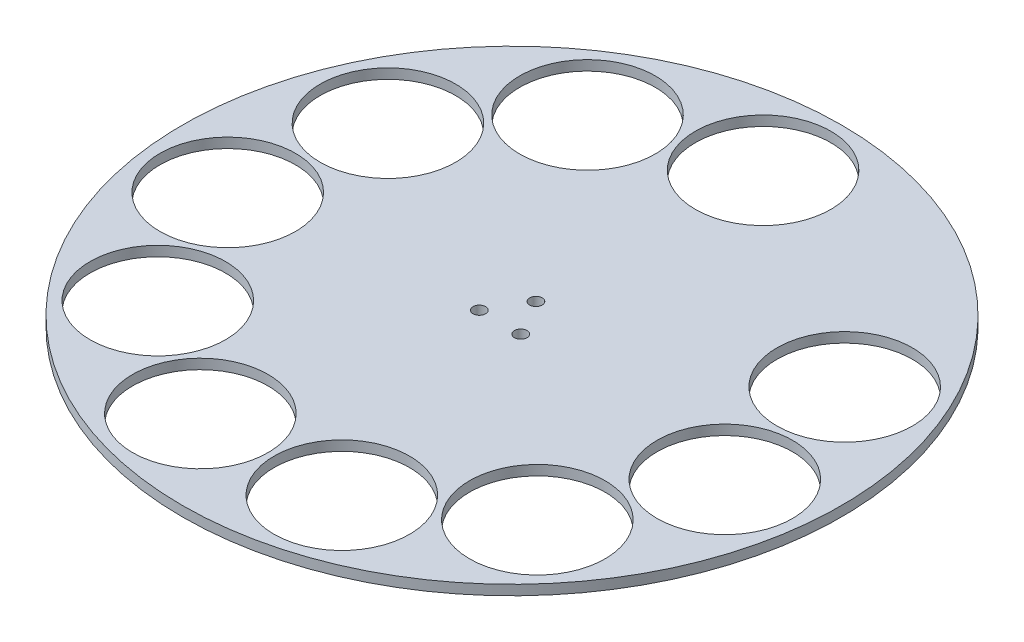
ISO-10303-21;
HEADER;
FILE_DESCRIPTION(('STEP AP214'),'2;1');
FILE_NAME('part.step','',(''),(''),'','','');
FILE_SCHEMA(('AUTOMOTIVE_DESIGN { 1 0 10303 214 1 1 1 1 }'));
ENDSEC;
DATA;
#1=APPLICATION_CONTEXT('core data for automotive mechanical design processes');
#2=APPLICATION_PROTOCOL_DEFINITION('international standard','automotive_design',2000,#1);
#3=PRODUCT_CONTEXT('',#1,'mechanical');
#4=PRODUCT('Part','Part','',(#3));
#5=PRODUCT_RELATED_PRODUCT_CATEGORY('part','',(#4));
#6=PRODUCT_DEFINITION_FORMATION('','',#4);
#7=PRODUCT_DEFINITION_CONTEXT('part definition',#1,'design');
#8=PRODUCT_DEFINITION('design','',#6,#7);
#9=PRODUCT_DEFINITION_SHAPE('','',#8);
#10=(LENGTH_UNIT() NAMED_UNIT(*) SI_UNIT(.MILLI.,.METRE.));
#11=(NAMED_UNIT(*) PLANE_ANGLE_UNIT() SI_UNIT($,.RADIAN.));
#12=(NAMED_UNIT(*) SI_UNIT($,.STERADIAN.) SOLID_ANGLE_UNIT());
#13=UNCERTAINTY_MEASURE_WITH_UNIT(LENGTH_MEASURE(1.E-05),#10,'distance_accuracy_value','');
#14=(GEOMETRIC_REPRESENTATION_CONTEXT(3) GLOBAL_UNCERTAINTY_ASSIGNED_CONTEXT((#13)) GLOBAL_UNIT_ASSIGNED_CONTEXT((#10,
#11,#12)) REPRESENTATION_CONTEXT('',''));
#15=CARTESIAN_POINT('',(0.,0.,0.));
#16=DIRECTION('',(0.,0.,1.));
#17=DIRECTION('',(1.,0.,0.));
#18=AXIS2_PLACEMENT_3D('',#15,#16,#17);
#19=CARTESIAN_POINT('',(0.,3.175,0.));
#20=DIRECTION('',(0.,1.,0.));
#21=DIRECTION('',(0.,0.,1.));
#22=AXIS2_PLACEMENT_3D('',#19,#20,#21);
#23=PLANE('',#22);
#24=CARTESIAN_POINT('',(6.59911357683764,3.175,3.80999999999988));
#25=DIRECTION('',(0.,1.,0.));
#26=DIRECTION('',(0.,0.,1.));
#27=AXIS2_PLACEMENT_3D('',#24,#25,#26);
#28=CIRCLE('',#27,2.);
#29=CARTESIAN_POINT('',(6.59911357683764,3.175,5.80999999999988));
#30=VERTEX_POINT('',#29);
#31=EDGE_CURVE('E107',#30,#30,#28,.T.);
#32=ORIENTED_EDGE('',*,*,#31,.F.);
#33=EDGE_LOOP('',(#32));
#34=FACE_BOUND('',#33,.T.);
#35=CARTESIAN_POINT('',(-72.7705596283575,3.175,-33.2332010401447));
#36=DIRECTION('',(0.,1.,0.));
#37=DIRECTION('',(0.,0.,1.));
#38=AXIS2_PLACEMENT_3D('',#35,#36,#37);
#39=CIRCLE('',#38,21.59);
#40=CARTESIAN_POINT('',(-72.7705596283575,3.175,-11.6432010401447));
#41=VERTEX_POINT('',#40);
#42=EDGE_CURVE('E95',#41,#41,#39,.T.);
#43=ORIENTED_EDGE('',*,*,#42,.F.);
#44=EDGE_LOOP('',(#43));
#45=FACE_BOUND('',#44,.T.);
#46=CARTESIAN_POINT('',(-60.4599659483295,3.175,52.3888587156279));
#47=DIRECTION('',(0.,1.,0.));
#48=DIRECTION('',(0.,0.,1.));
#49=AXIS2_PLACEMENT_3D('',#46,#47,#48);
#50=CIRCLE('',#49,21.59);
#51=CARTESIAN_POINT('',(-60.4599659483295,3.175,73.9788587156279));
#52=VERTEX_POINT('',#51);
#53=EDGE_CURVE('E83',#52,#52,#50,.T.);
#54=ORIENTED_EDGE('',*,*,#53,.F.);
#55=EDGE_LOOP('',(#54));
#56=FACE_BOUND('',#55,.T.);
#57=CARTESIAN_POINT('',(22.5386045473276,3.175,76.7594378891579));
#58=DIRECTION('',(0.,1.,0.));
#59=DIRECTION('',(0.,0.,1.));
#60=AXIS2_PLACEMENT_3D('',#57,#58,#59);
#61=CIRCLE('',#60,21.59);
#62=CARTESIAN_POINT('',(22.5386045473276,3.175,98.3494378891579));
#63=VERTEX_POINT('',#62);
#64=EDGE_CURVE('E71',#63,#63,#61,.T.);
#65=ORIENTED_EDGE('',*,*,#64,.F.);
#66=EDGE_LOOP('',(#65));
#67=FACE_BOUND('',#66,.T.);
#68=CARTESIAN_POINT('',(79.1857153504824,3.175,11.3851870618561));
#69=DIRECTION('',(0.,1.,0.));
#70=DIRECTION('',(0.,0.,1.));
#71=AXIS2_PLACEMENT_3D('',#68,#69,#70);
#72=CIRCLE('',#71,21.59);
#73=CARTESIAN_POINT('',(79.1857153504824,3.175,32.9751870618561));
#74=VERTEX_POINT('',#73);
#75=EDGE_CURVE('E59',#74,#74,#72,.T.);
#76=ORIENTED_EDGE('',*,*,#75,.F.);
#77=EDGE_LOOP('',(#76));
#78=FACE_BOUND('',#77,.T.);
#79=CARTESIAN_POINT('',(0.,3.175,-7.62));
#80=DIRECTION('',(0.,1.,0.));
#81=DIRECTION('',(0.,0.,1.));
#82=AXIS2_PLACEMENT_3D('',#79,#80,#81);
#83=CIRCLE('',#82,2.);
#84=CARTESIAN_POINT('',(0.,3.175,-5.62));
#85=VERTEX_POINT('',#84);
#86=EDGE_CURVE('E47',#85,#85,#83,.T.);
#87=ORIENTED_EDGE('',*,*,#86,.F.);
#88=EDGE_LOOP('',(#87));
#89=FACE_BOUND('',#88,.T.);
#90=CARTESIAN_POINT('',(0.,3.175,0.));
#91=DIRECTION('',(0.,1.,0.));
#92=DIRECTION('',(0.,0.,1.));
#93=AXIS2_PLACEMENT_3D('',#90,#91,#92);
#94=CIRCLE('',#93,105.);
#95=CARTESIAN_POINT('',(0.,3.175,105.));
#96=VERTEX_POINT('',#95);
#97=EDGE_CURVE('E10',#96,#96,#94,.T.);
#98=ORIENTED_EDGE('',*,*,#97,.T.);
#99=EDGE_LOOP('',(#98));
#100=FACE_BOUND('',#99,.T.);
#101=CARTESIAN_POINT('',(0.,3.175,-80.));
#102=DIRECTION('',(0.,1.,0.));
#103=DIRECTION('',(0.,0.,1.));
#104=AXIS2_PLACEMENT_3D('',#101,#102,#103);
#105=CIRCLE('',#104,21.59);
#106=CARTESIAN_POINT('',(0.,3.175,-58.41));
#107=VERTEX_POINT('',#106);
#108=EDGE_CURVE('E42',#107,#107,#105,.T.);
#109=ORIENTED_EDGE('',*,*,#108,.F.);
#110=EDGE_LOOP('',(#109));
#111=FACE_BOUND('',#110,.T.);
#112=CARTESIAN_POINT('',(72.7705596283654,3.175,-33.2332010401571));
#113=DIRECTION('',(0.,1.,0.));
#114=DIRECTION('',(0.,0.,1.));
#115=AXIS2_PLACEMENT_3D('',#112,#113,#114);
#116=CIRCLE('',#115,21.59);
#117=CARTESIAN_POINT('',(72.7705596283654,3.175,-11.6432010401571));
#118=VERTEX_POINT('',#117);
#119=EDGE_CURVE('E53',#118,#118,#116,.T.);
#120=ORIENTED_EDGE('',*,*,#119,.F.);
#121=EDGE_LOOP('',(#120));
#122=FACE_BOUND('',#121,.T.);
#123=CARTESIAN_POINT('',(60.4599659483519,3.175,52.3888587156177));
#124=DIRECTION('',(0.,1.,0.));
#125=DIRECTION('',(0.,0.,1.));
#126=AXIS2_PLACEMENT_3D('',#123,#124,#125);
#127=CIRCLE('',#126,21.59);
#128=CARTESIAN_POINT('',(60.4599659483519,3.175,73.9788587156177));
#129=VERTEX_POINT('',#128);
#130=EDGE_CURVE('E65',#129,#129,#127,.T.);
#131=ORIENTED_EDGE('',*,*,#130,.F.);
#132=EDGE_LOOP('',(#131));
#133=FACE_BOUND('',#132,.T.);
#134=CARTESIAN_POINT('',(-22.5386045473011,3.175,76.7594378891617));
#135=DIRECTION('',(0.,1.,0.));
#136=DIRECTION('',(0.,0.,1.));
#137=AXIS2_PLACEMENT_3D('',#134,#135,#136);
#138=CIRCLE('',#137,21.59);
#139=CARTESIAN_POINT('',(-22.5386045473011,3.175,98.3494378891617));
#140=VERTEX_POINT('',#139);
#141=EDGE_CURVE('E77',#140,#140,#138,.T.);
#142=ORIENTED_EDGE('',*,*,#141,.F.);
#143=EDGE_LOOP('',(#142));
#144=FACE_BOUND('',#143,.T.);
#145=CARTESIAN_POINT('',(-79.1857153504669,3.175,11.3851870618695));
#146=DIRECTION('',(0.,1.,0.));
#147=DIRECTION('',(0.,0.,1.));
#148=AXIS2_PLACEMENT_3D('',#145,#146,#147);
#149=CIRCLE('',#148,21.59);
#150=CARTESIAN_POINT('',(-79.1857153504669,3.175,32.9751870618695));
#151=VERTEX_POINT('',#150);
#152=EDGE_CURVE('E89',#151,#151,#149,.T.);
#153=ORIENTED_EDGE('',*,*,#152,.F.);
#154=EDGE_LOOP('',(#153));
#155=FACE_BOUND('',#154,.T.);
#156=CARTESIAN_POINT('',(-43.2512653964467,3.175,-67.3002826264909));
#157=DIRECTION('',(0.,1.,0.));
#158=DIRECTION('',(0.,0.,1.));
#159=AXIS2_PLACEMENT_3D('',#156,#157,#158);
#160=CIRCLE('',#159,21.59);
#161=CARTESIAN_POINT('',(-43.2512653964467,3.175,-45.7102826264908));
#162=VERTEX_POINT('',#161);
#163=EDGE_CURVE('E101',#162,#162,#160,.T.);
#164=ORIENTED_EDGE('',*,*,#163,.F.);
#165=EDGE_LOOP('',(#164));
#166=FACE_BOUND('',#165,.T.);
#167=CARTESIAN_POINT('',(-6.59911357683721,3.175,3.81000000000012));
#168=DIRECTION('',(0.,1.,0.));
#169=DIRECTION('',(0.,0.,1.));
#170=AXIS2_PLACEMENT_3D('',#167,#168,#169);
#171=CIRCLE('',#170,2.);
#172=CARTESIAN_POINT('',(-6.59911357683721,3.175,5.81000000000013));
#173=VERTEX_POINT('',#172);
#174=EDGE_CURVE('E113',#173,#173,#171,.T.);
#175=ORIENTED_EDGE('',*,*,#174,.F.);
#176=EDGE_LOOP('',(#175));
#177=FACE_BOUND('',#176,.T.);
#178=ADVANCED_FACE('F31',(#34,#45,#56,#67,#78,#89,#100,#111,#122,#133,#144,#155,#166,#177),#23,.T.);
#179=CARTESIAN_POINT('',(0.,0.,0.));
#180=DIRECTION('',(0.,1.,0.));
#181=DIRECTION('',(0.,0.,1.));
#182=AXIS2_PLACEMENT_3D('',#179,#180,#181);
#183=PLANE('',#182);
#184=CARTESIAN_POINT('',(0.,0.,0.));
#185=DIRECTION('',(0.,1.,0.));
#186=DIRECTION('',(0.,0.,1.));
#187=AXIS2_PLACEMENT_3D('',#184,#185,#186);
#188=CIRCLE('',#187,105.);
#189=CARTESIAN_POINT('',(0.,0.,105.));
#190=VERTEX_POINT('',#189);
#191=EDGE_CURVE('E35',#190,#190,#188,.T.);
#192=ORIENTED_EDGE('',*,*,#191,.F.);
#193=EDGE_LOOP('',(#192));
#194=FACE_BOUND('',#193,.T.);
#195=CARTESIAN_POINT('',(0.,0.,-80.));
#196=DIRECTION('',(0.,1.,0.));
#197=DIRECTION('',(0.,0.,1.));
#198=AXIS2_PLACEMENT_3D('',#195,#196,#197);
#199=CIRCLE('',#198,21.59);
#200=CARTESIAN_POINT('',(0.,0.,-58.41));
#201=VERTEX_POINT('',#200);
#202=EDGE_CURVE('E44',#201,#201,#199,.T.);
#203=ORIENTED_EDGE('',*,*,#202,.T.);
#204=EDGE_LOOP('',(#203));
#205=FACE_BOUND('',#204,.T.);
#206=CARTESIAN_POINT('',(0.,0.,-7.62));
#207=DIRECTION('',(0.,1.,0.));
#208=DIRECTION('',(0.,0.,1.));
#209=AXIS2_PLACEMENT_3D('',#206,#207,#208);
#210=CIRCLE('',#209,2.);
#211=CARTESIAN_POINT('',(0.,0.,-5.62));
#212=VERTEX_POINT('',#211);
#213=EDGE_CURVE('E50',#212,#212,#210,.T.);
#214=ORIENTED_EDGE('',*,*,#213,.T.);
#215=EDGE_LOOP('',(#214));
#216=FACE_BOUND('',#215,.T.);
#217=CARTESIAN_POINT('',(72.7705596283654,0.,-33.2332010401571));
#218=DIRECTION('',(0.,1.,0.));
#219=DIRECTION('',(0.,0.,1.));
#220=AXIS2_PLACEMENT_3D('',#217,#218,#219);
#221=CIRCLE('',#220,21.59);
#222=CARTESIAN_POINT('',(72.7705596283654,0.,-11.6432010401571));
#223=VERTEX_POINT('',#222);
#224=EDGE_CURVE('E56',#223,#223,#221,.T.);
#225=ORIENTED_EDGE('',*,*,#224,.T.);
#226=EDGE_LOOP('',(#225));
#227=FACE_BOUND('',#226,.T.);
#228=CARTESIAN_POINT('',(79.1857153504824,0.,11.3851870618561));
#229=DIRECTION('',(0.,1.,0.));
#230=DIRECTION('',(0.,0.,1.));
#231=AXIS2_PLACEMENT_3D('',#228,#229,#230);
#232=CIRCLE('',#231,21.59);
#233=CARTESIAN_POINT('',(79.1857153504824,0.,32.9751870618561));
#234=VERTEX_POINT('',#233);
#235=EDGE_CURVE('E62',#234,#234,#232,.T.);
#236=ORIENTED_EDGE('',*,*,#235,.T.);
#237=EDGE_LOOP('',(#236));
#238=FACE_BOUND('',#237,.T.);
#239=CARTESIAN_POINT('',(60.4599659483519,0.,52.3888587156177));
#240=DIRECTION('',(0.,1.,0.));
#241=DIRECTION('',(0.,0.,1.));
#242=AXIS2_PLACEMENT_3D('',#239,#240,#241);
#243=CIRCLE('',#242,21.59);
#244=CARTESIAN_POINT('',(60.4599659483519,0.,73.9788587156177));
#245=VERTEX_POINT('',#244);
#246=EDGE_CURVE('E68',#245,#245,#243,.T.);
#247=ORIENTED_EDGE('',*,*,#246,.T.);
#248=EDGE_LOOP('',(#247));
#249=FACE_BOUND('',#248,.T.);
#250=CARTESIAN_POINT('',(22.5386045473276,0.,76.7594378891579));
#251=DIRECTION('',(0.,1.,0.));
#252=DIRECTION('',(0.,0.,1.));
#253=AXIS2_PLACEMENT_3D('',#250,#251,#252);
#254=CIRCLE('',#253,21.59);
#255=CARTESIAN_POINT('',(22.5386045473276,0.,98.3494378891579));
#256=VERTEX_POINT('',#255);
#257=EDGE_CURVE('E74',#256,#256,#254,.T.);
#258=ORIENTED_EDGE('',*,*,#257,.T.);
#259=EDGE_LOOP('',(#258));
#260=FACE_BOUND('',#259,.T.);
#261=CARTESIAN_POINT('',(-22.5386045473011,0.,76.7594378891617));
#262=DIRECTION('',(0.,1.,0.));
#263=DIRECTION('',(0.,0.,1.));
#264=AXIS2_PLACEMENT_3D('',#261,#262,#263);
#265=CIRCLE('',#264,21.59);
#266=CARTESIAN_POINT('',(-22.5386045473011,0.,98.3494378891617));
#267=VERTEX_POINT('',#266);
#268=EDGE_CURVE('E80',#267,#267,#265,.T.);
#269=ORIENTED_EDGE('',*,*,#268,.T.);
#270=EDGE_LOOP('',(#269));
#271=FACE_BOUND('',#270,.T.);
#272=CARTESIAN_POINT('',(-60.4599659483295,0.,52.3888587156279));
#273=DIRECTION('',(0.,1.,0.));
#274=DIRECTION('',(0.,0.,1.));
#275=AXIS2_PLACEMENT_3D('',#272,#273,#274);
#276=CIRCLE('',#275,21.59);
#277=CARTESIAN_POINT('',(-60.4599659483295,0.,73.9788587156279));
#278=VERTEX_POINT('',#277);
#279=EDGE_CURVE('E86',#278,#278,#276,.T.);
#280=ORIENTED_EDGE('',*,*,#279,.T.);
#281=EDGE_LOOP('',(#280));
#282=FACE_BOUND('',#281,.T.);
#283=CARTESIAN_POINT('',(-79.1857153504669,0.,11.3851870618695));
#284=DIRECTION('',(0.,1.,0.));
#285=DIRECTION('',(0.,0.,1.));
#286=AXIS2_PLACEMENT_3D('',#283,#284,#285);
#287=CIRCLE('',#286,21.59);
#288=CARTESIAN_POINT('',(-79.1857153504669,0.,32.9751870618695));
#289=VERTEX_POINT('',#288);
#290=EDGE_CURVE('E92',#289,#289,#287,.T.);
#291=ORIENTED_EDGE('',*,*,#290,.T.);
#292=EDGE_LOOP('',(#291));
#293=FACE_BOUND('',#292,.T.);
#294=CARTESIAN_POINT('',(-72.7705596283575,0.,-33.2332010401447));
#295=DIRECTION('',(0.,1.,0.));
#296=DIRECTION('',(0.,0.,1.));
#297=AXIS2_PLACEMENT_3D('',#294,#295,#296);
#298=CIRCLE('',#297,21.59);
#299=CARTESIAN_POINT('',(-72.7705596283575,0.,-11.6432010401447));
#300=VERTEX_POINT('',#299);
#301=EDGE_CURVE('E98',#300,#300,#298,.T.);
#302=ORIENTED_EDGE('',*,*,#301,.T.);
#303=EDGE_LOOP('',(#302));
#304=FACE_BOUND('',#303,.T.);
#305=CARTESIAN_POINT('',(-43.2512653964467,0.,-67.3002826264909));
#306=DIRECTION('',(0.,1.,0.));
#307=DIRECTION('',(0.,0.,1.));
#308=AXIS2_PLACEMENT_3D('',#305,#306,#307);
#309=CIRCLE('',#308,21.59);
#310=CARTESIAN_POINT('',(-43.2512653964467,0.,-45.7102826264908));
#311=VERTEX_POINT('',#310);
#312=EDGE_CURVE('E104',#311,#311,#309,.T.);
#313=ORIENTED_EDGE('',*,*,#312,.T.);
#314=EDGE_LOOP('',(#313));
#315=FACE_BOUND('',#314,.T.);
#316=CARTESIAN_POINT('',(6.59911357683764,0.,3.80999999999988));
#317=DIRECTION('',(0.,1.,0.));
#318=DIRECTION('',(0.,0.,1.));
#319=AXIS2_PLACEMENT_3D('',#316,#317,#318);
#320=CIRCLE('',#319,2.);
#321=CARTESIAN_POINT('',(6.59911357683764,0.,5.80999999999988));
#322=VERTEX_POINT('',#321);
#323=EDGE_CURVE('E110',#322,#322,#320,.T.);
#324=ORIENTED_EDGE('',*,*,#323,.T.);
#325=EDGE_LOOP('',(#324));
#326=FACE_BOUND('',#325,.T.);
#327=CARTESIAN_POINT('',(-6.59911357683721,0.,3.81000000000012));
#328=DIRECTION('',(0.,1.,0.));
#329=DIRECTION('',(0.,0.,1.));
#330=AXIS2_PLACEMENT_3D('',#327,#328,#329);
#331=CIRCLE('',#330,2.);
#332=CARTESIAN_POINT('',(-6.59911357683721,0.,5.81000000000013));
#333=VERTEX_POINT('',#332);
#334=EDGE_CURVE('E116',#333,#333,#331,.T.);
#335=ORIENTED_EDGE('',*,*,#334,.T.);
#336=EDGE_LOOP('',(#335));
#337=FACE_BOUND('',#336,.T.);
#338=ADVANCED_FACE('F126',(#194,#205,#216,#227,#238,#249,#260,#271,#282,#293,#304,#315,#326,
#337),#183,.F.);
#339=CARTESIAN_POINT('',(0.,3.175,0.));
#340=DIRECTION('',(0.,-1.,0.));
#341=DIRECTION('',(0.,0.,-1.));
#342=AXIS2_PLACEMENT_3D('',#339,#340,#341);
#343=CYLINDRICAL_SURFACE('',#342,105.);
#344=ORIENTED_EDGE('',*,*,#97,.F.);
#345=EDGE_LOOP('',(#344));
#346=FACE_BOUND('',#345,.T.);
#347=ORIENTED_EDGE('',*,*,#191,.T.);
#348=EDGE_LOOP('',(#347));
#349=FACE_BOUND('',#348,.T.);
#350=ADVANCED_FACE('F33',(#346,#349),#343,.T.);
#351=CARTESIAN_POINT('',(0.,3.175,-80.));
#352=DIRECTION('',(0.,-1.,0.));
#353=DIRECTION('',(0.,0.,-1.));
#354=AXIS2_PLACEMENT_3D('',#351,#352,#353);
#355=CYLINDRICAL_SURFACE('',#354,21.59);
#356=ORIENTED_EDGE('',*,*,#108,.T.);
#357=EDGE_LOOP('',(#356));
#358=FACE_BOUND('',#357,.T.);
#359=ORIENTED_EDGE('',*,*,#202,.F.);
#360=EDGE_LOOP('',(#359));
#361=FACE_BOUND('',#360,.T.);
#362=ADVANCED_FACE('F136',(#358,#361),#355,.F.);
#363=CARTESIAN_POINT('',(0.,3.175,-7.62));
#364=DIRECTION('',(0.,-1.,0.));
#365=DIRECTION('',(0.,0.,-1.));
#366=AXIS2_PLACEMENT_3D('',#363,#364,#365);
#367=CYLINDRICAL_SURFACE('',#366,2.);
#368=ORIENTED_EDGE('',*,*,#86,.T.);
#369=EDGE_LOOP('',(#368));
#370=FACE_BOUND('',#369,.T.);
#371=ORIENTED_EDGE('',*,*,#213,.F.);
#372=EDGE_LOOP('',(#371));
#373=FACE_BOUND('',#372,.T.);
#374=ADVANCED_FACE('F139',(#370,#373),#367,.F.);
#375=CARTESIAN_POINT('',(72.7705596283654,3.175,-33.2332010401571));
#376=DIRECTION('',(0.,-1.,0.));
#377=DIRECTION('',(0.,0.,-1.));
#378=AXIS2_PLACEMENT_3D('',#375,#376,#377);
#379=CYLINDRICAL_SURFACE('',#378,21.59);
#380=ORIENTED_EDGE('',*,*,#119,.T.);
#381=EDGE_LOOP('',(#380));
#382=FACE_BOUND('',#381,.T.);
#383=ORIENTED_EDGE('',*,*,#224,.F.);
#384=EDGE_LOOP('',(#383));
#385=FACE_BOUND('',#384,.T.);
#386=ADVANCED_FACE('F143',(#382,#385),#379,.F.);
#387=CARTESIAN_POINT('',(79.1857153504824,3.175,11.3851870618561));
#388=DIRECTION('',(0.,-1.,0.));
#389=DIRECTION('',(0.,0.,-1.));
#390=AXIS2_PLACEMENT_3D('',#387,#388,#389);
#391=CYLINDRICAL_SURFACE('',#390,21.59);
#392=ORIENTED_EDGE('',*,*,#75,.T.);
#393=EDGE_LOOP('',(#392));
#394=FACE_BOUND('',#393,.T.);
#395=ORIENTED_EDGE('',*,*,#235,.F.);
#396=EDGE_LOOP('',(#395));
#397=FACE_BOUND('',#396,.T.);
#398=ADVANCED_FACE('F147',(#394,#397),#391,.F.);
#399=CARTESIAN_POINT('',(60.4599659483519,3.175,52.3888587156177));
#400=DIRECTION('',(0.,-1.,0.));
#401=DIRECTION('',(0.,0.,-1.));
#402=AXIS2_PLACEMENT_3D('',#399,#400,#401);
#403=CYLINDRICAL_SURFACE('',#402,21.59);
#404=ORIENTED_EDGE('',*,*,#130,.T.);
#405=EDGE_LOOP('',(#404));
#406=FACE_BOUND('',#405,.T.);
#407=ORIENTED_EDGE('',*,*,#246,.F.);
#408=EDGE_LOOP('',(#407));
#409=FACE_BOUND('',#408,.T.);
#410=ADVANCED_FACE('F151',(#406,#409),#403,.F.);
#411=CARTESIAN_POINT('',(22.5386045473276,3.175,76.7594378891579));
#412=DIRECTION('',(0.,-1.,0.));
#413=DIRECTION('',(0.,0.,-1.));
#414=AXIS2_PLACEMENT_3D('',#411,#412,#413);
#415=CYLINDRICAL_SURFACE('',#414,21.59);
#416=ORIENTED_EDGE('',*,*,#64,.T.);
#417=EDGE_LOOP('',(#416));
#418=FACE_BOUND('',#417,.T.);
#419=ORIENTED_EDGE('',*,*,#257,.F.);
#420=EDGE_LOOP('',(#419));
#421=FACE_BOUND('',#420,.T.);
#422=ADVANCED_FACE('F155',(#418,#421),#415,.F.);
#423=CARTESIAN_POINT('',(-22.5386045473011,3.175,76.7594378891617));
#424=DIRECTION('',(0.,-1.,0.));
#425=DIRECTION('',(0.,0.,-1.));
#426=AXIS2_PLACEMENT_3D('',#423,#424,#425);
#427=CYLINDRICAL_SURFACE('',#426,21.59);
#428=ORIENTED_EDGE('',*,*,#141,.T.);
#429=EDGE_LOOP('',(#428));
#430=FACE_BOUND('',#429,.T.);
#431=ORIENTED_EDGE('',*,*,#268,.F.);
#432=EDGE_LOOP('',(#431));
#433=FACE_BOUND('',#432,.T.);
#434=ADVANCED_FACE('F159',(#430,#433),#427,.F.);
#435=CARTESIAN_POINT('',(-60.4599659483295,3.175,52.3888587156279));
#436=DIRECTION('',(0.,-1.,0.));
#437=DIRECTION('',(0.,0.,-1.));
#438=AXIS2_PLACEMENT_3D('',#435,#436,#437);
#439=CYLINDRICAL_SURFACE('',#438,21.59);
#440=ORIENTED_EDGE('',*,*,#53,.T.);
#441=EDGE_LOOP('',(#440));
#442=FACE_BOUND('',#441,.T.);
#443=ORIENTED_EDGE('',*,*,#279,.F.);
#444=EDGE_LOOP('',(#443));
#445=FACE_BOUND('',#444,.T.);
#446=ADVANCED_FACE('F163',(#442,#445),#439,.F.);
#447=CARTESIAN_POINT('',(-79.1857153504669,3.175,11.3851870618695));
#448=DIRECTION('',(0.,-1.,0.));
#449=DIRECTION('',(0.,0.,-1.));
#450=AXIS2_PLACEMENT_3D('',#447,#448,#449);
#451=CYLINDRICAL_SURFACE('',#450,21.59);
#452=ORIENTED_EDGE('',*,*,#152,.T.);
#453=EDGE_LOOP('',(#452));
#454=FACE_BOUND('',#453,.T.);
#455=ORIENTED_EDGE('',*,*,#290,.F.);
#456=EDGE_LOOP('',(#455));
#457=FACE_BOUND('',#456,.T.);
#458=ADVANCED_FACE('F167',(#454,#457),#451,.F.);
#459=CARTESIAN_POINT('',(-72.7705596283575,3.175,-33.2332010401447));
#460=DIRECTION('',(0.,-1.,0.));
#461=DIRECTION('',(0.,0.,-1.));
#462=AXIS2_PLACEMENT_3D('',#459,#460,#461);
#463=CYLINDRICAL_SURFACE('',#462,21.59);
#464=ORIENTED_EDGE('',*,*,#42,.T.);
#465=EDGE_LOOP('',(#464));
#466=FACE_BOUND('',#465,.T.);
#467=ORIENTED_EDGE('',*,*,#301,.F.);
#468=EDGE_LOOP('',(#467));
#469=FACE_BOUND('',#468,.T.);
#470=ADVANCED_FACE('F171',(#466,#469),#463,.F.);
#471=CARTESIAN_POINT('',(-43.2512653964467,3.175,-67.3002826264909));
#472=DIRECTION('',(0.,-1.,0.));
#473=DIRECTION('',(0.,0.,-1.));
#474=AXIS2_PLACEMENT_3D('',#471,#472,#473);
#475=CYLINDRICAL_SURFACE('',#474,21.59);
#476=ORIENTED_EDGE('',*,*,#163,.T.);
#477=EDGE_LOOP('',(#476));
#478=FACE_BOUND('',#477,.T.);
#479=ORIENTED_EDGE('',*,*,#312,.F.);
#480=EDGE_LOOP('',(#479));
#481=FACE_BOUND('',#480,.T.);
#482=ADVANCED_FACE('F175',(#478,#481),#475,.F.);
#483=CARTESIAN_POINT('',(6.59911357683764,3.175,3.80999999999988));
#484=DIRECTION('',(0.,-1.,0.));
#485=DIRECTION('',(0.,0.,-1.));
#486=AXIS2_PLACEMENT_3D('',#483,#484,#485);
#487=CYLINDRICAL_SURFACE('',#486,2.);
#488=ORIENTED_EDGE('',*,*,#31,.T.);
#489=EDGE_LOOP('',(#488));
#490=FACE_BOUND('',#489,.T.);
#491=ORIENTED_EDGE('',*,*,#323,.F.);
#492=EDGE_LOOP('',(#491));
#493=FACE_BOUND('',#492,.T.);
#494=ADVANCED_FACE('F179',(#490,#493),#487,.F.);
#495=CARTESIAN_POINT('',(-6.59911357683721,3.175,3.81000000000012));
#496=DIRECTION('',(0.,-1.,0.));
#497=DIRECTION('',(0.,0.,-1.));
#498=AXIS2_PLACEMENT_3D('',#495,#496,#497);
#499=CYLINDRICAL_SURFACE('',#498,2.);
#500=ORIENTED_EDGE('',*,*,#174,.T.);
#501=EDGE_LOOP('',(#500));
#502=FACE_BOUND('',#501,.T.);
#503=ORIENTED_EDGE('',*,*,#334,.F.);
#504=EDGE_LOOP('',(#503));
#505=FACE_BOUND('',#504,.T.);
#506=ADVANCED_FACE('F122',(#502,#505),#499,.F.);
#507=CLOSED_SHELL('',(#178,#338,#350,#362,#374,#386,#398,#410,#422,#434,#446,#458,#470,#482,
#494,#506));
#508=MANIFOLD_SOLID_BREP('B2',#507);
#509=ADVANCED_BREP_SHAPE_REPRESENTATION('',(#18,#508),#14);
#510=SHAPE_DEFINITION_REPRESENTATION(#9,#509);
ENDSEC;
END-ISO-10303-21;
